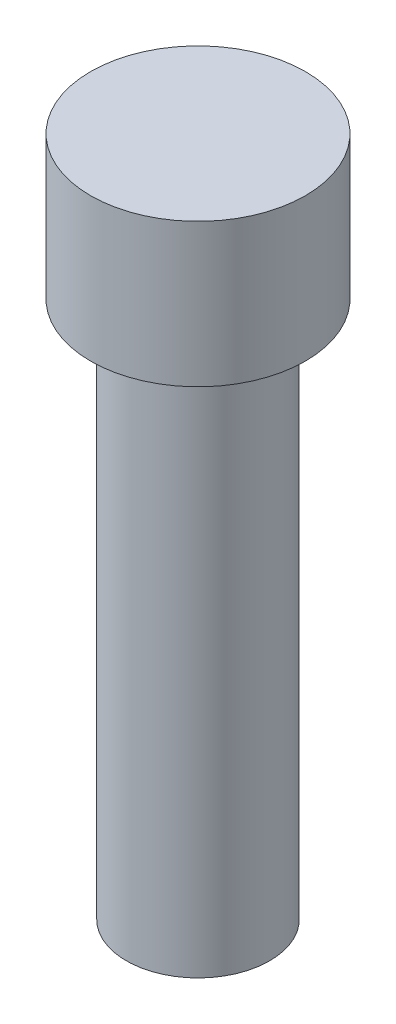
ISO-10303-21;
HEADER;
FILE_DESCRIPTION(('STEP AP214'),'2;1');
FILE_NAME('part.step','',(''),(''),'','','');
FILE_SCHEMA(('AUTOMOTIVE_DESIGN { 1 0 10303 214 1 1 1 1 }'));
ENDSEC;
DATA;
#1=APPLICATION_CONTEXT('core data for automotive mechanical design processes');
#2=APPLICATION_PROTOCOL_DEFINITION('international standard','automotive_design',2000,#1);
#3=PRODUCT_CONTEXT('',#1,'mechanical');
#4=PRODUCT('Part','Part','',(#3));
#5=PRODUCT_RELATED_PRODUCT_CATEGORY('part','',(#4));
#6=PRODUCT_DEFINITION_FORMATION('','',#4);
#7=PRODUCT_DEFINITION_CONTEXT('part definition',#1,'design');
#8=PRODUCT_DEFINITION('design','',#6,#7);
#9=PRODUCT_DEFINITION_SHAPE('','',#8);
#10=(LENGTH_UNIT() NAMED_UNIT(*) SI_UNIT(.MILLI.,.METRE.));
#11=(NAMED_UNIT(*) PLANE_ANGLE_UNIT() SI_UNIT($,.RADIAN.));
#12=(NAMED_UNIT(*) SI_UNIT($,.STERADIAN.) SOLID_ANGLE_UNIT());
#13=UNCERTAINTY_MEASURE_WITH_UNIT(LENGTH_MEASURE(1.E-05),#10,'distance_accuracy_value','');
#14=(GEOMETRIC_REPRESENTATION_CONTEXT(3) GLOBAL_UNCERTAINTY_ASSIGNED_CONTEXT((#13)) GLOBAL_UNIT_ASSIGNED_CONTEXT((#10,
#11,#12)) REPRESENTATION_CONTEXT('',''));
#15=CARTESIAN_POINT('',(0.,0.,0.));
#16=DIRECTION('',(0.,0.,1.));
#17=DIRECTION('',(1.,0.,0.));
#18=AXIS2_PLACEMENT_3D('',#15,#16,#17);
#19=CARTESIAN_POINT('',(0.,0.,0.));
#20=DIRECTION('',(0.,1.,0.));
#21=DIRECTION('',(0.,0.,1.));
#22=AXIS2_PLACEMENT_3D('',#19,#20,#21);
#23=PLANE('',#22);
#24=CARTESIAN_POINT('',(0.,0.,0.));
#25=DIRECTION('',(0.,-1.,0.));
#26=DIRECTION('',(0.,0.,-1.));
#27=AXIS2_PLACEMENT_3D('',#24,#25,#26);
#28=CIRCLE('',#27,1.99999999999999);
#29=CARTESIAN_POINT('',(0.,0.,-1.99999999999999));
#30=VERTEX_POINT('',#29);
#31=EDGE_CURVE('E10',#30,#30,#28,.T.);
#32=ORIENTED_EDGE('',*,*,#31,.T.);
#33=EDGE_LOOP('',(#32));
#34=FACE_BOUND('',#33,.T.);
#35=ADVANCED_FACE('F32',(#34),#23,.F.);
#36=CARTESIAN_POINT('',(0.,0.,0.));
#37=DIRECTION('',(0.,-1.,0.));
#38=DIRECTION('',(0.,0.,-1.));
#39=AXIS2_PLACEMENT_3D('',#36,#37,#38);
#40=CYLINDRICAL_SURFACE('',#39,1.99999999999999);
#41=ORIENTED_EDGE('',*,*,#31,.F.);
#42=EDGE_LOOP('',(#41));
#43=FACE_BOUND('',#42,.T.);
#44=CARTESIAN_POINT('',(0.,15.,0.));
#45=DIRECTION('',(0.,-1.,0.));
#46=DIRECTION('',(0.,0.,-1.));
#47=AXIS2_PLACEMENT_3D('',#44,#45,#46);
#48=CIRCLE('',#47,2.);
#49=CARTESIAN_POINT('',(0.,15.,-2.));
#50=VERTEX_POINT('',#49);
#51=EDGE_CURVE('E38',#50,#50,#48,.T.);
#52=ORIENTED_EDGE('',*,*,#51,.T.);
#53=EDGE_LOOP('',(#52));
#54=FACE_BOUND('',#53,.T.);
#55=ADVANCED_FACE('F64',(#43,#54),#40,.T.);
#56=CARTESIAN_POINT('',(-2.,15.,0.));
#57=DIRECTION('',(0.,1.,0.));
#58=DIRECTION('',(0.,0.,1.));
#59=AXIS2_PLACEMENT_3D('',#56,#57,#58);
#60=PLANE('',#59);
#61=ORIENTED_EDGE('',*,*,#51,.F.);
#62=EDGE_LOOP('',(#61));
#63=FACE_BOUND('',#62,.T.);
#64=CARTESIAN_POINT('',(0.,15.,0.));
#65=DIRECTION('',(0.,-1.,0.));
#66=DIRECTION('',(0.,0.,-1.));
#67=AXIS2_PLACEMENT_3D('',#64,#65,#66);
#68=CIRCLE('',#67,3.);
#69=CARTESIAN_POINT('',(0.,15.,-3.));
#70=VERTEX_POINT('',#69);
#71=EDGE_CURVE('E42',#70,#70,#68,.T.);
#72=ORIENTED_EDGE('',*,*,#71,.T.);
#73=EDGE_LOOP('',(#72));
#74=FACE_BOUND('',#73,.T.);
#75=ADVANCED_FACE('F60',(#63,#74),#60,.F.);
#76=CARTESIAN_POINT('',(0.,0.,0.));
#77=DIRECTION('',(0.,-1.,0.));
#78=DIRECTION('',(0.,0.,-1.));
#79=AXIS2_PLACEMENT_3D('',#76,#77,#78);
#80=CYLINDRICAL_SURFACE('',#79,3.);
#81=ORIENTED_EDGE('',*,*,#71,.F.);
#82=EDGE_LOOP('',(#81));
#83=FACE_BOUND('',#82,.T.);
#84=CARTESIAN_POINT('',(0.,19.,0.));
#85=DIRECTION('',(0.,-1.,0.));
#86=DIRECTION('',(0.,0.,-1.));
#87=AXIS2_PLACEMENT_3D('',#84,#85,#86);
#88=CIRCLE('',#87,3.);
#89=CARTESIAN_POINT('',(0.,19.,-3.));
#90=VERTEX_POINT('',#89);
#91=EDGE_CURVE('E46',#90,#90,#88,.T.);
#92=ORIENTED_EDGE('',*,*,#91,.T.);
#93=EDGE_LOOP('',(#92));
#94=FACE_BOUND('',#93,.T.);
#95=ADVANCED_FACE('F52',(#83,#94),#80,.T.);
#96=CARTESIAN_POINT('',(-3.,19.,0.));
#97=DIRECTION('',(0.,-1.,0.));
#98=DIRECTION('',(0.,0.,-1.));
#99=AXIS2_PLACEMENT_3D('',#96,#97,#98);
#100=PLANE('',#99);
#101=ORIENTED_EDGE('',*,*,#91,.F.);
#102=EDGE_LOOP('',(#101));
#103=FACE_BOUND('',#102,.T.);
#104=ADVANCED_FACE('F54',(#103),#100,.F.);
#105=CLOSED_SHELL('',(#35,#55,#75,#95,#104));
#106=MANIFOLD_SOLID_BREP('B2',#105);
#107=ADVANCED_BREP_SHAPE_REPRESENTATION('',(#18,#106),#14);
#108=SHAPE_DEFINITION_REPRESENTATION(#9,#107);
ENDSEC;
END-ISO-10303-21;
